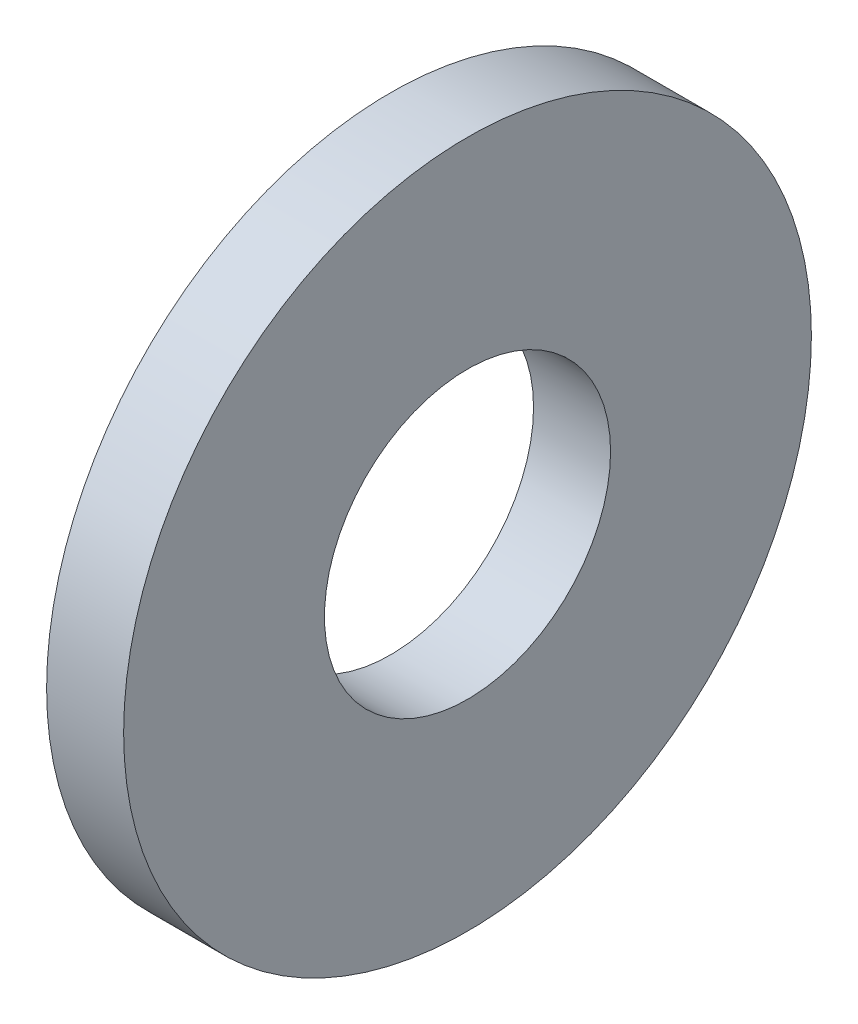
ISO-10303-21;
HEADER;
FILE_DESCRIPTION(('STEP AP214'),'2;1');
FILE_NAME('part.step','',(''),(''),'','','');
FILE_SCHEMA(('AUTOMOTIVE_DESIGN { 1 0 10303 214 1 1 1 1 }'));
ENDSEC;
DATA;
#1=APPLICATION_CONTEXT('core data for automotive mechanical design processes');
#2=APPLICATION_PROTOCOL_DEFINITION('international standard','automotive_design',2000,#1);
#3=PRODUCT_CONTEXT('',#1,'mechanical');
#4=PRODUCT('Part','Part','',(#3));
#5=PRODUCT_RELATED_PRODUCT_CATEGORY('part','',(#4));
#6=PRODUCT_DEFINITION_FORMATION('','',#4);
#7=PRODUCT_DEFINITION_CONTEXT('part definition',#1,'design');
#8=PRODUCT_DEFINITION('design','',#6,#7);
#9=PRODUCT_DEFINITION_SHAPE('','',#8);
#10=(LENGTH_UNIT() NAMED_UNIT(*) SI_UNIT(.MILLI.,.METRE.));
#11=(NAMED_UNIT(*) PLANE_ANGLE_UNIT() SI_UNIT($,.RADIAN.));
#12=(NAMED_UNIT(*) SI_UNIT($,.STERADIAN.) SOLID_ANGLE_UNIT());
#13=UNCERTAINTY_MEASURE_WITH_UNIT(LENGTH_MEASURE(1.E-05),#10,'distance_accuracy_value','');
#14=(GEOMETRIC_REPRESENTATION_CONTEXT(3) GLOBAL_UNCERTAINTY_ASSIGNED_CONTEXT((#13)) GLOBAL_UNIT_ASSIGNED_CONTEXT((#10,
#11,#12)) REPRESENTATION_CONTEXT('',''));
#15=CARTESIAN_POINT('',(0.,0.,0.));
#16=DIRECTION('',(0.,0.,1.));
#17=DIRECTION('',(1.,0.,0.));
#18=AXIS2_PLACEMENT_3D('',#15,#16,#17);
#19=CARTESIAN_POINT('',(1.778,0.,0.));
#20=DIRECTION('',(1.,0.,0.));
#21=DIRECTION('',(0.,0.,-1.));
#22=AXIS2_PLACEMENT_3D('',#19,#20,#21);
#23=PLANE('',#22);
#24=CARTESIAN_POINT('',(1.778,0.,0.));
#25=DIRECTION('',(1.,0.,0.));
#26=DIRECTION('',(0.,0.,-1.));
#27=AXIS2_PLACEMENT_3D('',#24,#25,#26);
#28=CIRCLE('',#27,7.9375);
#29=CARTESIAN_POINT('',(1.778,0.,-7.9375));
#30=VERTEX_POINT('',#29);
#31=EDGE_CURVE('E10',#30,#30,#28,.T.);
#32=ORIENTED_EDGE('',*,*,#31,.T.);
#33=EDGE_LOOP('',(#32));
#34=FACE_BOUND('',#33,.T.);
#35=CARTESIAN_POINT('',(1.778,0.,0.));
#36=DIRECTION('',(1.,0.,0.));
#37=DIRECTION('',(0.,0.,-1.));
#38=AXIS2_PLACEMENT_3D('',#35,#36,#37);
#39=CIRCLE('',#38,3.302);
#40=CARTESIAN_POINT('',(1.778,0.,-3.302));
#41=VERTEX_POINT('',#40);
#42=EDGE_CURVE('E41',#41,#41,#39,.T.);
#43=ORIENTED_EDGE('',*,*,#42,.F.);
#44=EDGE_LOOP('',(#43));
#45=FACE_BOUND('',#44,.T.);
#46=ADVANCED_FACE('F30',(#34,#45),#23,.T.);
#47=CARTESIAN_POINT('',(0.,0.,0.));
#48=DIRECTION('',(1.,0.,0.));
#49=DIRECTION('',(0.,0.,-1.));
#50=AXIS2_PLACEMENT_3D('',#47,#48,#49);
#51=PLANE('',#50);
#52=CARTESIAN_POINT('',(0.,0.,0.));
#53=DIRECTION('',(1.,0.,0.));
#54=DIRECTION('',(0.,0.,-1.));
#55=AXIS2_PLACEMENT_3D('',#52,#53,#54);
#56=CIRCLE('',#55,7.9375);
#57=CARTESIAN_POINT('',(0.,0.,-7.9375));
#58=VERTEX_POINT('',#57);
#59=EDGE_CURVE('E34',#58,#58,#56,.T.);
#60=ORIENTED_EDGE('',*,*,#59,.F.);
#61=EDGE_LOOP('',(#60));
#62=FACE_BOUND('',#61,.T.);
#63=CARTESIAN_POINT('',(0.,0.,0.));
#64=DIRECTION('',(1.,0.,0.));
#65=DIRECTION('',(0.,0.,-1.));
#66=AXIS2_PLACEMENT_3D('',#63,#64,#65);
#67=CIRCLE('',#66,3.302);
#68=CARTESIAN_POINT('',(0.,0.,-3.302));
#69=VERTEX_POINT('',#68);
#70=EDGE_CURVE('E43',#69,#69,#67,.T.);
#71=ORIENTED_EDGE('',*,*,#70,.T.);
#72=EDGE_LOOP('',(#71));
#73=FACE_BOUND('',#72,.T.);
#74=ADVANCED_FACE('F53',(#62,#73),#51,.F.);
#75=CARTESIAN_POINT('',(1.778,0.,0.));
#76=DIRECTION('',(-1.,0.,0.));
#77=DIRECTION('',(0.,0.,1.));
#78=AXIS2_PLACEMENT_3D('',#75,#76,#77);
#79=CYLINDRICAL_SURFACE('',#78,7.9375);
#80=ORIENTED_EDGE('',*,*,#31,.F.);
#81=EDGE_LOOP('',(#80));
#82=FACE_BOUND('',#81,.T.);
#83=ORIENTED_EDGE('',*,*,#59,.T.);
#84=EDGE_LOOP('',(#83));
#85=FACE_BOUND('',#84,.T.);
#86=ADVANCED_FACE('F32',(#82,#85),#79,.T.);
#87=CARTESIAN_POINT('',(1.778,0.,0.));
#88=DIRECTION('',(-1.,0.,0.));
#89=DIRECTION('',(0.,0.,1.));
#90=AXIS2_PLACEMENT_3D('',#87,#88,#89);
#91=CYLINDRICAL_SURFACE('',#90,3.302);
#92=ORIENTED_EDGE('',*,*,#42,.T.);
#93=EDGE_LOOP('',(#92));
#94=FACE_BOUND('',#93,.T.);
#95=ORIENTED_EDGE('',*,*,#70,.F.);
#96=EDGE_LOOP('',(#95));
#97=FACE_BOUND('',#96,.T.);
#98=ADVANCED_FACE('F49',(#94,#97),#91,.F.);
#99=CLOSED_SHELL('',(#46,#74,#86,#98));
#100=MANIFOLD_SOLID_BREP('B2',#99);
#101=ADVANCED_BREP_SHAPE_REPRESENTATION('',(#18,#100),#14);
#102=SHAPE_DEFINITION_REPRESENTATION(#9,#101);
ENDSEC;
END-ISO-10303-21;
